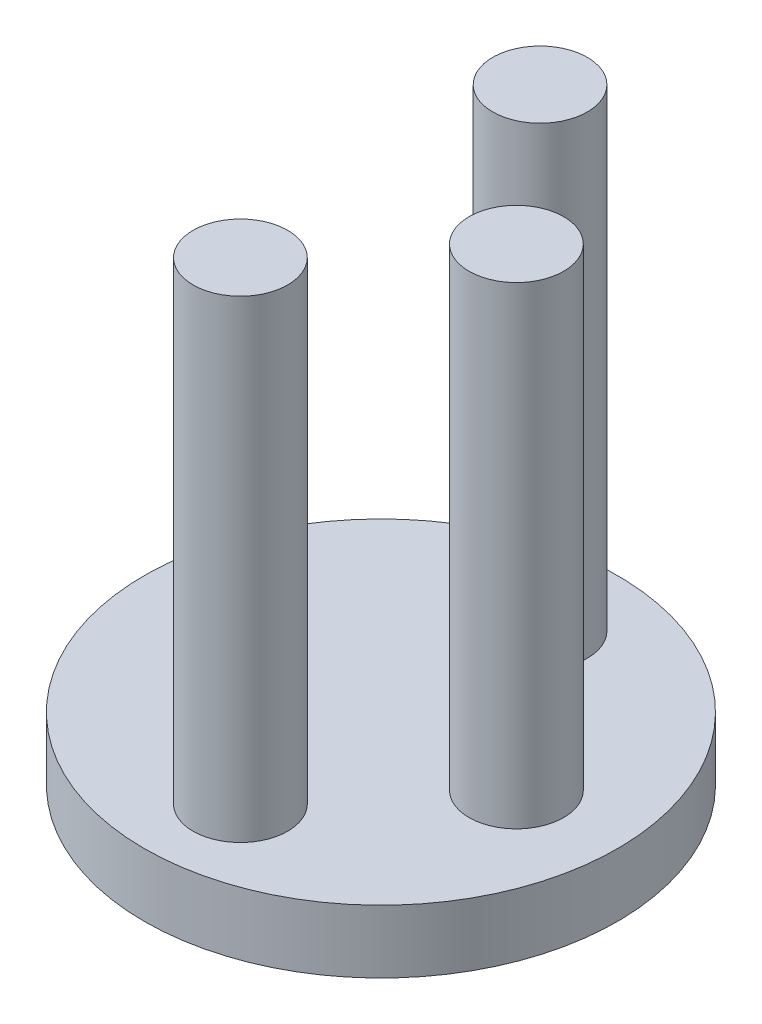
ISO-10303-21;
HEADER;
FILE_DESCRIPTION(('STEP AP214'),'2;1');
FILE_NAME('part.step','',(''),(''),'','','');
FILE_SCHEMA(('AUTOMOTIVE_DESIGN { 1 0 10303 214 1 1 1 1 }'));
ENDSEC;
DATA;
#1=APPLICATION_CONTEXT('core data for automotive mechanical design processes');
#2=APPLICATION_PROTOCOL_DEFINITION('international standard','automotive_design',2000,#1);
#3=PRODUCT_CONTEXT('',#1,'mechanical');
#4=PRODUCT('Part','Part','',(#3));
#5=PRODUCT_RELATED_PRODUCT_CATEGORY('part','',(#4));
#6=PRODUCT_DEFINITION_FORMATION('','',#4);
#7=PRODUCT_DEFINITION_CONTEXT('part definition',#1,'design');
#8=PRODUCT_DEFINITION('design','',#6,#7);
#9=PRODUCT_DEFINITION_SHAPE('','',#8);
#10=(LENGTH_UNIT() NAMED_UNIT(*) SI_UNIT(.MILLI.,.METRE.));
#11=(NAMED_UNIT(*) PLANE_ANGLE_UNIT() SI_UNIT($,.RADIAN.));
#12=(NAMED_UNIT(*) SI_UNIT($,.STERADIAN.) SOLID_ANGLE_UNIT());
#13=UNCERTAINTY_MEASURE_WITH_UNIT(LENGTH_MEASURE(1.E-05),#10,'distance_accuracy_value','');
#14=(GEOMETRIC_REPRESENTATION_CONTEXT(3) GLOBAL_UNCERTAINTY_ASSIGNED_CONTEXT((#13)) GLOBAL_UNIT_ASSIGNED_CONTEXT((#10,
#11,#12)) REPRESENTATION_CONTEXT('',''));
#15=CARTESIAN_POINT('',(0.,0.,0.));
#16=DIRECTION('',(0.,0.,1.));
#17=DIRECTION('',(1.,0.,0.));
#18=AXIS2_PLACEMENT_3D('',#15,#16,#17);
#19=CARTESIAN_POINT('',(0.,2.,0.));
#20=DIRECTION('',(0.,-1.,0.));
#21=DIRECTION('',(0.,0.,-1.));
#22=AXIS2_PLACEMENT_3D('',#19,#20,#21);
#23=CYLINDRICAL_SURFACE('',#22,7.5);
#24=CARTESIAN_POINT('',(0.,2.,0.));
#25=DIRECTION('',(0.,1.,0.));
#26=DIRECTION('',(0.,0.,1.));
#27=AXIS2_PLACEMENT_3D('',#24,#25,#26);
#28=CIRCLE('',#27,7.5);
#29=CARTESIAN_POINT('',(0.,2.,7.5));
#30=VERTEX_POINT('',#29);
#31=EDGE_CURVE('E10',#30,#30,#28,.T.);
#32=ORIENTED_EDGE('',*,*,#31,.F.);
#33=EDGE_LOOP('',(#32));
#34=FACE_BOUND('',#33,.T.);
#35=CARTESIAN_POINT('',(0.,0.,0.));
#36=DIRECTION('',(0.,1.,0.));
#37=DIRECTION('',(0.,0.,1.));
#38=AXIS2_PLACEMENT_3D('',#35,#36,#37);
#39=CIRCLE('',#38,7.5);
#40=CARTESIAN_POINT('',(0.,0.,7.5));
#41=VERTEX_POINT('',#40);
#42=EDGE_CURVE('E34',#41,#41,#39,.T.);
#43=ORIENTED_EDGE('',*,*,#42,.T.);
#44=EDGE_LOOP('',(#43));
#45=FACE_BOUND('',#44,.T.);
#46=ADVANCED_FACE('F31',(#34,#45),#23,.T.);
#47=CARTESIAN_POINT('',(0.,2.,0.));
#48=DIRECTION('',(0.,1.,0.));
#49=DIRECTION('',(0.,0.,1.));
#50=AXIS2_PLACEMENT_3D('',#47,#48,#49);
#51=PLANE('',#50);
#52=CARTESIAN_POINT('',(4.29407707211249,2.,0.));
#53=DIRECTION('',(0.,1.,0.));
#54=DIRECTION('',(0.,0.,1.));
#55=AXIS2_PLACEMENT_3D('',#52,#53,#54);
#56=CIRCLE('',#55,1.5);
#57=CARTESIAN_POINT('',(4.29407707211249,2.,1.5));
#58=VERTEX_POINT('',#57);
#59=EDGE_CURVE('E55',#58,#58,#56,.T.);
#60=ORIENTED_EDGE('',*,*,#59,.F.);
#61=EDGE_LOOP('',(#60));
#62=FACE_BOUND('',#61,.T.);
#63=CARTESIAN_POINT('',(0.29407707211249,2.,-4.75));
#64=DIRECTION('',(0.,1.,0.));
#65=DIRECTION('',(0.,0.,1.));
#66=AXIS2_PLACEMENT_3D('',#63,#64,#65);
#67=CIRCLE('',#66,1.5);
#68=CARTESIAN_POINT('',(0.29407707211249,2.,-3.25));
#69=VERTEX_POINT('',#68);
#70=EDGE_CURVE('E49',#69,#69,#67,.T.);
#71=ORIENTED_EDGE('',*,*,#70,.F.);
#72=EDGE_LOOP('',(#71));
#73=FACE_BOUND('',#72,.T.);
#74=CARTESIAN_POINT('',(0.294077072112492,2.,4.75));
#75=DIRECTION('',(0.,1.,0.));
#76=DIRECTION('',(0.,0.,1.));
#77=AXIS2_PLACEMENT_3D('',#74,#75,#76);
#78=CIRCLE('',#77,1.5);
#79=CARTESIAN_POINT('',(0.294077072112492,2.,6.25));
#80=VERTEX_POINT('',#79);
#81=EDGE_CURVE('E43',#80,#80,#78,.T.);
#82=ORIENTED_EDGE('',*,*,#81,.F.);
#83=EDGE_LOOP('',(#82));
#84=FACE_BOUND('',#83,.T.);
#85=ORIENTED_EDGE('',*,*,#31,.T.);
#86=EDGE_LOOP('',(#85));
#87=FACE_BOUND('',#86,.T.);
#88=ADVANCED_FACE('F70',(#62,#73,#84,#87),#51,.T.);
#89=CARTESIAN_POINT('',(0.,0.,0.));
#90=DIRECTION('',(0.,1.,0.));
#91=DIRECTION('',(0.,0.,1.));
#92=AXIS2_PLACEMENT_3D('',#89,#90,#91);
#93=PLANE('',#92);
#94=ORIENTED_EDGE('',*,*,#42,.F.);
#95=EDGE_LOOP('',(#94));
#96=FACE_BOUND('',#95,.T.);
#97=ADVANCED_FACE('F73',(#96),#93,.F.);
#98=CARTESIAN_POINT('',(0.294077072112492,17.,4.75));
#99=DIRECTION('',(0.,-1.,0.));
#100=DIRECTION('',(0.,0.,-1.));
#101=AXIS2_PLACEMENT_3D('',#98,#99,#100);
#102=CYLINDRICAL_SURFACE('',#101,1.5);
#103=CARTESIAN_POINT('',(0.294077072112492,17.,4.75));
#104=DIRECTION('',(0.,1.,0.));
#105=DIRECTION('',(0.,0.,1.));
#106=AXIS2_PLACEMENT_3D('',#103,#104,#105);
#107=CIRCLE('',#106,1.5);
#108=CARTESIAN_POINT('',(0.294077072112492,17.,6.25));
#109=VERTEX_POINT('',#108);
#110=EDGE_CURVE('E41',#109,#109,#107,.T.);
#111=ORIENTED_EDGE('',*,*,#110,.F.);
#112=EDGE_LOOP('',(#111));
#113=FACE_BOUND('',#112,.T.);
#114=ORIENTED_EDGE('',*,*,#81,.T.);
#115=EDGE_LOOP('',(#114));
#116=FACE_BOUND('',#115,.T.);
#117=ADVANCED_FACE('F79',(#113,#116),#102,.T.);
#118=CARTESIAN_POINT('',(0.294077072112492,17.,4.75));
#119=DIRECTION('',(0.,1.,0.));
#120=DIRECTION('',(0.,0.,1.));
#121=AXIS2_PLACEMENT_3D('',#118,#119,#120);
#122=PLANE('',#121);
#123=ORIENTED_EDGE('',*,*,#110,.T.);
#124=EDGE_LOOP('',(#123));
#125=FACE_BOUND('',#124,.T.);
#126=ADVANCED_FACE('F81',(#125),#122,.T.);
#127=CARTESIAN_POINT('',(0.29407707211249,17.,-4.75));
#128=DIRECTION('',(0.,-1.,0.));
#129=DIRECTION('',(0.,0.,-1.));
#130=AXIS2_PLACEMENT_3D('',#127,#128,#129);
#131=CYLINDRICAL_SURFACE('',#130,1.5);
#132=CARTESIAN_POINT('',(0.29407707211249,17.,-4.75));
#133=DIRECTION('',(0.,1.,0.));
#134=DIRECTION('',(0.,0.,1.));
#135=AXIS2_PLACEMENT_3D('',#132,#133,#134);
#136=CIRCLE('',#135,1.5);
#137=CARTESIAN_POINT('',(0.29407707211249,17.,-3.25));
#138=VERTEX_POINT('',#137);
#139=EDGE_CURVE('E46',#138,#138,#136,.T.);
#140=ORIENTED_EDGE('',*,*,#139,.F.);
#141=EDGE_LOOP('',(#140));
#142=FACE_BOUND('',#141,.T.);
#143=ORIENTED_EDGE('',*,*,#70,.T.);
#144=EDGE_LOOP('',(#143));
#145=FACE_BOUND('',#144,.T.);
#146=ADVANCED_FACE('F88',(#142,#145),#131,.T.);
#147=CARTESIAN_POINT('',(0.29407707211249,17.,-4.75));
#148=DIRECTION('',(0.,1.,0.));
#149=DIRECTION('',(0.,0.,1.));
#150=AXIS2_PLACEMENT_3D('',#147,#148,#149);
#151=PLANE('',#150);
#152=ORIENTED_EDGE('',*,*,#139,.T.);
#153=EDGE_LOOP('',(#152));
#154=FACE_BOUND('',#153,.T.);
#155=ADVANCED_FACE('F66',(#154),#151,.T.);
#156=CARTESIAN_POINT('',(4.29407707211249,17.,0.));
#157=DIRECTION('',(0.,-1.,0.));
#158=DIRECTION('',(0.,0.,-1.));
#159=AXIS2_PLACEMENT_3D('',#156,#157,#158);
#160=CYLINDRICAL_SURFACE('',#159,1.5);
#161=CARTESIAN_POINT('',(4.29407707211249,17.,0.));
#162=DIRECTION('',(0.,1.,0.));
#163=DIRECTION('',(0.,0.,1.));
#164=AXIS2_PLACEMENT_3D('',#161,#162,#163);
#165=CIRCLE('',#164,1.5);
#166=CARTESIAN_POINT('',(4.29407707211249,17.,1.5));
#167=VERTEX_POINT('',#166);
#168=EDGE_CURVE('E52',#167,#167,#165,.T.);
#169=ORIENTED_EDGE('',*,*,#168,.F.);
#170=EDGE_LOOP('',(#169));
#171=FACE_BOUND('',#170,.T.);
#172=ORIENTED_EDGE('',*,*,#59,.T.);
#173=EDGE_LOOP('',(#172));
#174=FACE_BOUND('',#173,.T.);
#175=ADVANCED_FACE('F63',(#171,#174),#160,.T.);
#176=CARTESIAN_POINT('',(4.29407707211249,17.,0.));
#177=DIRECTION('',(0.,1.,0.));
#178=DIRECTION('',(0.,0.,1.));
#179=AXIS2_PLACEMENT_3D('',#176,#177,#178);
#180=PLANE('',#179);
#181=ORIENTED_EDGE('',*,*,#168,.T.);
#182=EDGE_LOOP('',(#181));
#183=FACE_BOUND('',#182,.T.);
#184=ADVANCED_FACE('F61',(#183),#180,.T.);
#185=CLOSED_SHELL('',(#46,#88,#97,#117,#126,#146,#155,#175,#184));
#186=MANIFOLD_SOLID_BREP('B2',#185);
#187=ADVANCED_BREP_SHAPE_REPRESENTATION('',(#18,#186),#14);
#188=SHAPE_DEFINITION_REPRESENTATION(#9,#187);
ENDSEC;
END-ISO-10303-21;
